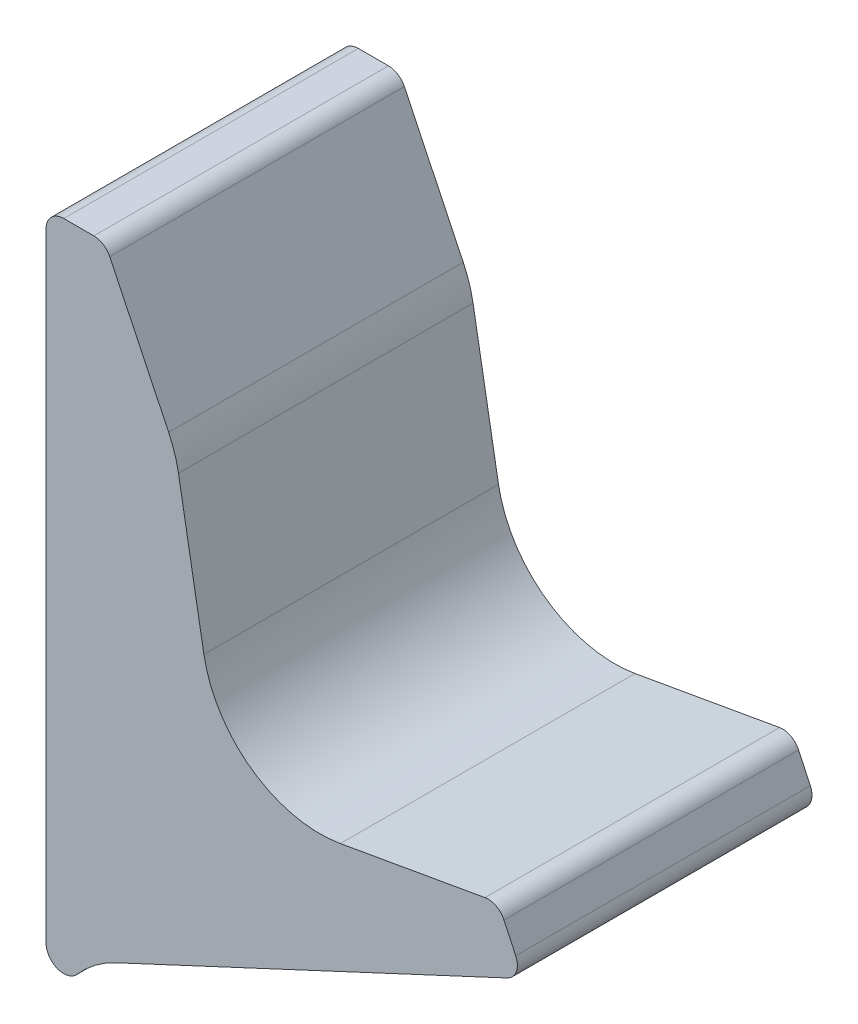
ISO-10303-21;
HEADER;
FILE_DESCRIPTION(('STEP AP214'),'2;1');
FILE_NAME('part.step','',(''),(''),'','','');
FILE_SCHEMA(('AUTOMOTIVE_DESIGN { 1 0 10303 214 1 1 1 1 }'));
ENDSEC;
DATA;
#1=APPLICATION_CONTEXT('core data for automotive mechanical design processes');
#2=APPLICATION_PROTOCOL_DEFINITION('international standard','automotive_design',2000,#1);
#3=PRODUCT_CONTEXT('',#1,'mechanical');
#4=PRODUCT('Part','Part','',(#3));
#5=PRODUCT_RELATED_PRODUCT_CATEGORY('part','',(#4));
#6=PRODUCT_DEFINITION_FORMATION('','',#4);
#7=PRODUCT_DEFINITION_CONTEXT('part definition',#1,'design');
#8=PRODUCT_DEFINITION('design','',#6,#7);
#9=PRODUCT_DEFINITION_SHAPE('','',#8);
#10=(LENGTH_UNIT() NAMED_UNIT(*) SI_UNIT(.MILLI.,.METRE.));
#11=(NAMED_UNIT(*) PLANE_ANGLE_UNIT() SI_UNIT($,.RADIAN.));
#12=(NAMED_UNIT(*) SI_UNIT($,.STERADIAN.) SOLID_ANGLE_UNIT());
#13=UNCERTAINTY_MEASURE_WITH_UNIT(LENGTH_MEASURE(1.E-05),#10,'distance_accuracy_value','');
#14=(GEOMETRIC_REPRESENTATION_CONTEXT(3) GLOBAL_UNCERTAINTY_ASSIGNED_CONTEXT((#13)) GLOBAL_UNIT_ASSIGNED_CONTEXT((#10,
#11,#12)) REPRESENTATION_CONTEXT('',''));
#15=CARTESIAN_POINT('',(0.,0.,0.));
#16=DIRECTION('',(0.,0.,1.));
#17=DIRECTION('',(1.,0.,0.));
#18=AXIS2_PLACEMENT_3D('',#15,#16,#17);
#19=CARTESIAN_POINT('',(3.00000000000001,-108.,25.));
#20=DIRECTION('',(0.,0.,-1.));
#21=DIRECTION('',(-1.,0.,0.));
#22=AXIS2_PLACEMENT_3D('',#19,#20,#21);
#23=CYLINDRICAL_SURFACE('',#22,3.);
#24=CARTESIAN_POINT('',(3.00000000000001,-108.,-25.));
#25=DIRECTION('',(0.,0.,1.));
#26=DIRECTION('',(1.,0.,0.));
#27=AXIS2_PLACEMENT_3D('',#24,#25,#26);
#28=CIRCLE('',#27,3.);
#29=CARTESIAN_POINT('',(0.,-108.,-25.));
#30=VERTEX_POINT('',#29);
#31=CARTESIAN_POINT('',(5.26655271543777,-109.965385150077,-25.));
#32=VERTEX_POINT('',#31);
#33=EDGE_CURVE('E178',#30,#32,#28,.T.);
#34=ORIENTED_EDGE('',*,*,#33,.T.);
#35=DIRECTION('',(0.,0.,-1.));
#36=VECTOR('',#35,1.);
#37=CARTESIAN_POINT('',(5.26655271543777,-109.965385150077,25.));
#38=LINE('',#37,#36);
#39=CARTESIAN_POINT('',(5.26655271543777,-109.965385150077,25.));
#40=VERTEX_POINT('',#39);
#41=EDGE_CURVE('E11',#40,#32,#38,.T.);
#42=ORIENTED_EDGE('',*,*,#41,.F.);
#43=CARTESIAN_POINT('',(3.00000000000001,-108.,25.));
#44=DIRECTION('',(0.,0.,1.));
#45=DIRECTION('',(1.,0.,0.));
#46=AXIS2_PLACEMENT_3D('',#43,#44,#45);
#47=CIRCLE('',#46,3.);
#48=CARTESIAN_POINT('',(0.,-108.,25.));
#49=VERTEX_POINT('',#48);
#50=EDGE_CURVE('E207',#49,#40,#47,.T.);
#51=ORIENTED_EDGE('',*,*,#50,.F.);
#52=DIRECTION('',(0.,0.,-1.));
#53=VECTOR('',#52,1.);
#54=CARTESIAN_POINT('',(0.,-108.,25.));
#55=LINE('',#54,#53);
#56=EDGE_CURVE('E174',#49,#30,#55,.T.);
#57=ORIENTED_EDGE('',*,*,#56,.T.);
#58=EDGE_LOOP('',(#34,#42,#51,#57));
#59=FACE_BOUND('',#58,.T.);
#60=ADVANCED_FACE('F39',(#59),#23,.T.);
#61=CARTESIAN_POINT('',(20.3769041516896,-123.067952817254,25.));
#62=DIRECTION('',(0.,0.,-1.));
#63=DIRECTION('',(-1.,0.,0.));
#64=AXIS2_PLACEMENT_3D('',#61,#62,#63);
#65=CYLINDRICAL_SURFACE('',#64,20.);
#66=CARTESIAN_POINT('',(20.3769041516896,-123.067952817254,-25.));
#67=DIRECTION('',(0.,0.,-1.));
#68=DIRECTION('',(-1.,0.,0.));
#69=AXIS2_PLACEMENT_3D('',#66,#67,#68);
#70=CIRCLE('',#69,20.);
#71=CARTESIAN_POINT('',(11.9245389168755,-104.941797076521,-25.));
#72=VERTEX_POINT('',#71);
#73=EDGE_CURVE('E181',#32,#72,#70,.T.);
#74=ORIENTED_EDGE('',*,*,#73,.T.);
#75=DIRECTION('',(0.,0.,-1.));
#76=VECTOR('',#75,1.);
#77=CARTESIAN_POINT('',(11.9245389168755,-104.941797076521,25.));
#78=LINE('',#77,#76);
#79=CARTESIAN_POINT('',(11.9245389168755,-104.941797076521,25.));
#80=VERTEX_POINT('',#79);
#81=EDGE_CURVE('E47',#80,#72,#78,.T.);
#82=ORIENTED_EDGE('',*,*,#81,.F.);
#83=CARTESIAN_POINT('',(20.3769041516896,-123.067952817254,25.));
#84=DIRECTION('',(0.,0.,-1.));
#85=DIRECTION('',(-1.,0.,0.));
#86=AXIS2_PLACEMENT_3D('',#83,#84,#85);
#87=CIRCLE('',#86,20.);
#88=EDGE_CURVE('E117',#40,#80,#87,.T.);
#89=ORIENTED_EDGE('',*,*,#88,.F.);
#90=ORIENTED_EDGE('',*,*,#41,.T.);
#91=EDGE_LOOP('',(#74,#82,#89,#90));
#92=FACE_BOUND('',#91,.T.);
#93=ADVANCED_FACE('F290',(#92),#65,.F.);
#94=CARTESIAN_POINT('',(11.9245389168755,-104.941797076521,25.));
#95=DIRECTION('',(-0.422618261740704,0.906307787036648,0.));
#96=DIRECTION('',(-0.906307787036648,-0.422618261740704,0.));
#97=AXIS2_PLACEMENT_3D('',#94,#95,#96);
#98=PLANE('',#97);
#99=DIRECTION('',(0.906307787036648,0.422618261740704,0.));
#100=VECTOR('',#99,1.);
#101=CARTESIAN_POINT('',(11.9245389168755,-104.941797076521,-25.));
#102=LINE('',#101,#100);
#103=CARTESIAN_POINT('',(78.2678547852221,-74.0054008197146,-25.));
#104=VERTEX_POINT('',#103);
#105=EDGE_CURVE('E183',#72,#104,#102,.T.);
#106=ORIENTED_EDGE('',*,*,#105,.T.);
#107=DIRECTION('',(0.,0.,-1.));
#108=VECTOR('',#107,1.);
#109=CARTESIAN_POINT('',(78.2678547852221,-74.0054008197146,25.));
#110=LINE('',#109,#108);
#111=CARTESIAN_POINT('',(78.2678547852221,-74.0054008197146,25.));
#112=VERTEX_POINT('',#111);
#113=EDGE_CURVE('E235',#112,#104,#110,.T.);
#114=ORIENTED_EDGE('',*,*,#113,.F.);
#115=DIRECTION('',(0.906307787036648,0.422618261740704,0.));
#116=VECTOR('',#115,1.);
#117=CARTESIAN_POINT('',(11.9245389168755,-104.941797076521,25.));
#118=LINE('',#117,#116);
#119=EDGE_CURVE('E243',#80,#112,#118,.T.);
#120=ORIENTED_EDGE('',*,*,#119,.F.);
#121=ORIENTED_EDGE('',*,*,#81,.T.);
#122=EDGE_LOOP('',(#106,#114,#120,#121));
#123=FACE_BOUND('',#122,.T.);
#124=ADVANCED_FACE('F241',(#123),#98,.F.);
#125=CARTESIAN_POINT('',(77.,-71.2864774586047,25.));
#126=DIRECTION('',(0.,0.,-1.));
#127=DIRECTION('',(-1.,0.,0.));
#128=AXIS2_PLACEMENT_3D('',#125,#126,#127);
#129=CYLINDRICAL_SURFACE('',#128,3.);
#130=CARTESIAN_POINT('',(77.,-71.2864774586047,-25.));
#131=DIRECTION('',(0.,0.,1.));
#132=DIRECTION('',(1.,0.,0.));
#133=AXIS2_PLACEMENT_3D('',#130,#131,#132);
#134=CIRCLE('',#133,3.);
#135=CARTESIAN_POINT('',(79.7189233611099,-70.0186226733826,-25.));
#136=VERTEX_POINT('',#135);
#137=EDGE_CURVE('E185',#104,#136,#134,.T.);
#138=ORIENTED_EDGE('',*,*,#137,.T.);
#139=DIRECTION('',(0.,0.,-1.));
#140=VECTOR('',#139,1.);
#141=CARTESIAN_POINT('',(79.7189233611099,-70.0186226733826,25.));
#142=LINE('',#141,#140);
#143=CARTESIAN_POINT('',(79.7189233611099,-70.0186226733826,25.));
#144=VERTEX_POINT('',#143);
#145=EDGE_CURVE('E232',#144,#136,#142,.T.);
#146=ORIENTED_EDGE('',*,*,#145,.F.);
#147=CARTESIAN_POINT('',(77.,-71.2864774586047,25.));
#148=DIRECTION('',(0.,0.,1.));
#149=DIRECTION('',(1.,0.,0.));
#150=AXIS2_PLACEMENT_3D('',#147,#148,#149);
#151=CIRCLE('',#150,3.);
#152=EDGE_CURVE('E259',#112,#144,#151,.T.);
#153=ORIENTED_EDGE('',*,*,#152,.F.);
#154=ORIENTED_EDGE('',*,*,#113,.T.);
#155=EDGE_LOOP('',(#138,#146,#153,#154));
#156=FACE_BOUND('',#155,.T.);
#157=ADVANCED_FACE('F250',(#156),#129,.T.);
#158=CARTESIAN_POINT('',(79.7189233611099,-70.0186226733826,25.));
#159=DIRECTION('',(-0.906307787036648,-0.422618261740705,0.));
#160=DIRECTION('',(0.422618261740705,-0.906307787036648,0.));
#161=AXIS2_PLACEMENT_3D('',#158,#159,#160);
#162=PLANE('',#161);
#163=DIRECTION('',(-0.422618261740705,0.906307787036648,0.));
#164=VECTOR('',#163,1.);
#165=CARTESIAN_POINT('',(79.7189233611099,-70.0186226733826,-25.));
#166=LINE('',#165,#164);
#167=CARTESIAN_POINT('',(77.7334547224642,-65.7607714373522,-25.));
#168=VERTEX_POINT('',#167);
#169=EDGE_CURVE('E187',#136,#168,#166,.T.);
#170=ORIENTED_EDGE('',*,*,#169,.T.);
#171=DIRECTION('',(0.,0.,-1.));
#172=VECTOR('',#171,1.);
#173=CARTESIAN_POINT('',(77.7334547224642,-65.7607714373522,25.));
#174=LINE('',#173,#172);
#175=CARTESIAN_POINT('',(77.7334547224642,-65.7607714373522,25.));
#176=VERTEX_POINT('',#175);
#177=EDGE_CURVE('E229',#176,#168,#174,.T.);
#178=ORIENTED_EDGE('',*,*,#177,.F.);
#179=DIRECTION('',(-0.422618261740705,0.906307787036648,0.));
#180=VECTOR('',#179,1.);
#181=CARTESIAN_POINT('',(79.7189233611099,-70.0186226733826,25.));
#182=LINE('',#181,#180);
#183=EDGE_CURVE('E256',#144,#176,#182,.T.);
#184=ORIENTED_EDGE('',*,*,#183,.F.);
#185=ORIENTED_EDGE('',*,*,#145,.T.);
#186=EDGE_LOOP('',(#170,#178,#184,#185));
#187=FACE_BOUND('',#186,.T.);
#188=ADVANCED_FACE('F254',(#187),#162,.F.);
#189=CARTESIAN_POINT('',(75.0145313613543,-67.0286262225743,25.));
#190=DIRECTION('',(0.,0.,-1.));
#191=DIRECTION('',(-1.,0.,0.));
#192=AXIS2_PLACEMENT_3D('',#189,#190,#191);
#193=CYLINDRICAL_SURFACE('',#192,3.00000000000001);
#194=CARTESIAN_POINT('',(75.0145313613543,-67.0286262225743,-25.));
#195=DIRECTION('',(0.,0.,1.));
#196=DIRECTION('',(1.,0.,0.));
#197=AXIS2_PLACEMENT_3D('',#194,#195,#196);
#198=CIRCLE('',#197,3.00000000000001);
#199=CARTESIAN_POINT('',(74.4935868283534,-64.0742029635376,-25.));
#200=VERTEX_POINT('',#199);
#201=EDGE_CURVE('E189',#168,#200,#198,.T.);
#202=ORIENTED_EDGE('',*,*,#201,.T.);
#203=DIRECTION('',(0.,0.,-1.));
#204=VECTOR('',#203,1.);
#205=CARTESIAN_POINT('',(74.4935868283534,-64.0742029635376,25.));
#206=LINE('',#205,#204);
#207=CARTESIAN_POINT('',(74.4935868283534,-64.0742029635376,25.));
#208=VERTEX_POINT('',#207);
#209=EDGE_CURVE('E226',#208,#200,#206,.T.);
#210=ORIENTED_EDGE('',*,*,#209,.F.);
#211=CARTESIAN_POINT('',(75.0145313613543,-67.0286262225743,25.));
#212=DIRECTION('',(0.,0.,1.));
#213=DIRECTION('',(1.,0.,0.));
#214=AXIS2_PLACEMENT_3D('',#211,#212,#213);
#215=CIRCLE('',#214,3.00000000000001);
#216=EDGE_CURVE('E258',#176,#208,#215,.T.);
#217=ORIENTED_EDGE('',*,*,#216,.F.);
#218=ORIENTED_EDGE('',*,*,#177,.T.);
#219=EDGE_LOOP('',(#202,#210,#217,#218));
#220=FACE_BOUND('',#219,.T.);
#221=ADVANCED_FACE('F302',(#220),#193,.T.);
#222=CARTESIAN_POINT('',(74.4935868283534,-64.0742029635376,25.));
#223=DIRECTION('',(0.173648177666942,-0.984807753012206,0.));
#224=DIRECTION('',(0.984807753012206,0.173648177666942,0.));
#225=AXIS2_PLACEMENT_3D('',#222,#223,#224);
#226=PLANE('',#225);
#227=DIRECTION('',(-0.984807753012206,-0.173648177666942,0.));
#228=VECTOR('',#227,1.);
#229=CARTESIAN_POINT('',(74.4935868283534,-64.0742029635376,-25.));
#230=LINE('',#229,#228);
#231=CARTESIAN_POINT('',(49.9611126327896,-68.3999400677501,-25.));
#232=VERTEX_POINT('',#231);
#233=EDGE_CURVE('E191',#200,#232,#230,.T.);
#234=ORIENTED_EDGE('',*,*,#233,.T.);
#235=DIRECTION('',(0.,0.,-1.));
#236=VECTOR('',#235,1.);
#237=CARTESIAN_POINT('',(49.9611126327896,-68.3999400677501,25.));
#238=LINE('',#237,#236);
#239=CARTESIAN_POINT('',(49.9611126327896,-68.3999400677501,25.));
#240=VERTEX_POINT('',#239);
#241=EDGE_CURVE('E223',#240,#232,#238,.T.);
#242=ORIENTED_EDGE('',*,*,#241,.F.);
#243=DIRECTION('',(-0.984807753012206,-0.173648177666942,0.));
#244=VECTOR('',#243,1.);
#245=CARTESIAN_POINT('',(74.4935868283534,-64.0742029635376,25.));
#246=LINE('',#245,#244);
#247=EDGE_CURVE('E261',#208,#240,#246,.T.);
#248=ORIENTED_EDGE('',*,*,#247,.F.);
#249=ORIENTED_EDGE('',*,*,#209,.T.);
#250=EDGE_LOOP('',(#234,#242,#248,#249));
#251=FACE_BOUND('',#250,.T.);
#252=ADVANCED_FACE('F305',(#251),#226,.F.);
#253=CARTESIAN_POINT('',(46.4881490794508,-48.7037850075059,25.));
#254=DIRECTION('',(0.,0.,-1.));
#255=DIRECTION('',(-1.,0.,0.));
#256=AXIS2_PLACEMENT_3D('',#253,#254,#255);
#257=CYLINDRICAL_SURFACE('',#256,20.);
#258=CARTESIAN_POINT('',(46.4881490794508,-48.7037850075059,-25.));
#259=DIRECTION('',(0.,0.,-1.));
#260=DIRECTION('',(-1.,0.,0.));
#261=AXIS2_PLACEMENT_3D('',#258,#259,#260);
#262=CIRCLE('',#261,20.);
#263=CARTESIAN_POINT('',(26.7919940192066,-52.1767485608444,-25.));
#264=VERTEX_POINT('',#263);
#265=EDGE_CURVE('E193',#232,#264,#262,.T.);
#266=ORIENTED_EDGE('',*,*,#265,.T.);
#267=DIRECTION('',(0.,0.,-1.));
#268=VECTOR('',#267,1.);
#269=CARTESIAN_POINT('',(26.7919940192066,-52.1767485608444,25.));
#270=LINE('',#269,#268);
#271=CARTESIAN_POINT('',(26.7919940192066,-52.1767485608444,25.));
#272=VERTEX_POINT('',#271);
#273=EDGE_CURVE('E220',#272,#264,#270,.T.);
#274=ORIENTED_EDGE('',*,*,#273,.F.);
#275=CARTESIAN_POINT('',(46.4881490794508,-48.7037850075059,25.));
#276=DIRECTION('',(0.,0.,-1.));
#277=DIRECTION('',(-1.,0.,0.));
#278=AXIS2_PLACEMENT_3D('',#275,#276,#277);
#279=CIRCLE('',#278,20.);
#280=EDGE_CURVE('E267',#240,#272,#279,.T.);
#281=ORIENTED_EDGE('',*,*,#280,.F.);
#282=ORIENTED_EDGE('',*,*,#241,.T.);
#283=EDGE_LOOP('',(#266,#274,#281,#282));
#284=FACE_BOUND('',#283,.T.);
#285=ADVANCED_FACE('F309',(#284),#257,.F.);
#286=CARTESIAN_POINT('',(26.7919940192066,-52.1767485608444,25.));
#287=DIRECTION('',(-0.984807753012209,-0.173648177666924,0.));
#288=DIRECTION('',(0.173648177666924,-0.984807753012209,0.));
#289=AXIS2_PLACEMENT_3D('',#286,#287,#288);
#290=PLANE('',#289);
#291=DIRECTION('',(-0.173648177666924,0.984807753012209,0.));
#292=VECTOR('',#291,1.);
#293=CARTESIAN_POINT('',(26.7919940192066,-52.1767485608444,-25.));
#294=LINE('',#293,#292);
#295=CARTESIAN_POINT('',(22.4770029885421,-27.7052183768224,-25.));
#296=VERTEX_POINT('',#295);
#297=EDGE_CURVE('E195',#264,#296,#294,.T.);
#298=ORIENTED_EDGE('',*,*,#297,.T.);
#299=DIRECTION('',(0.,0.,-1.));
#300=VECTOR('',#299,1.);
#301=CARTESIAN_POINT('',(22.4770029885421,-27.7052183768224,25.));
#302=LINE('',#301,#300);
#303=CARTESIAN_POINT('',(22.4770029885421,-27.7052183768224,25.));
#304=VERTEX_POINT('',#303);
#305=EDGE_CURVE('E217',#304,#296,#302,.T.);
#306=ORIENTED_EDGE('',*,*,#305,.F.);
#307=DIRECTION('',(-0.173648177666924,0.984807753012209,0.));
#308=VECTOR('',#307,1.);
#309=CARTESIAN_POINT('',(26.7919940192066,-52.1767485608444,25.));
#310=LINE('',#309,#308);
#311=EDGE_CURVE('E269',#272,#304,#310,.T.);
#312=ORIENTED_EDGE('',*,*,#311,.F.);
#313=ORIENTED_EDGE('',*,*,#273,.T.);
#314=EDGE_LOOP('',(#298,#306,#312,#313));
#315=FACE_BOUND('',#314,.T.);
#316=ADVANCED_FACE('F313',(#315),#290,.F.);
#317=CARTESIAN_POINT('',(2.78084792829795,-31.1781819301609,25.));
#318=DIRECTION('',(0.,0.,-1.));
#319=DIRECTION('',(-1.,0.,0.));
#320=AXIS2_PLACEMENT_3D('',#317,#318,#319);
#321=CYLINDRICAL_SURFACE('',#320,20.);
#322=CARTESIAN_POINT('',(2.78084792829795,-31.1781819301609,-25.));
#323=DIRECTION('',(0.,0.,1.));
#324=DIRECTION('',(1.,0.,0.));
#325=AXIS2_PLACEMENT_3D('',#322,#323,#324);
#326=CIRCLE('',#325,20.);
#327=CARTESIAN_POINT('',(20.8113090776634,-22.5235605784655,-25.));
#328=VERTEX_POINT('',#327);
#329=EDGE_CURVE('E197',#296,#328,#326,.T.);
#330=ORIENTED_EDGE('',*,*,#329,.T.);
#331=DIRECTION('',(0.,0.,-1.));
#332=VECTOR('',#331,1.);
#333=CARTESIAN_POINT('',(20.8113090776634,-22.5235605784655,25.));
#334=LINE('',#333,#332);
#335=CARTESIAN_POINT('',(20.8113090776634,-22.5235605784655,25.));
#336=VERTEX_POINT('',#335);
#337=EDGE_CURVE('E214',#336,#328,#334,.T.);
#338=ORIENTED_EDGE('',*,*,#337,.F.);
#339=CARTESIAN_POINT('',(2.78084792829795,-31.1781819301609,25.));
#340=DIRECTION('',(0.,0.,1.));
#341=DIRECTION('',(1.,0.,0.));
#342=AXIS2_PLACEMENT_3D('',#339,#340,#341);
#343=CIRCLE('',#342,20.);
#344=EDGE_CURVE('E271',#304,#336,#343,.T.);
#345=ORIENTED_EDGE('',*,*,#344,.F.);
#346=ORIENTED_EDGE('',*,*,#305,.T.);
#347=EDGE_LOOP('',(#330,#338,#345,#346));
#348=FACE_BOUND('',#347,.T.);
#349=ADVANCED_FACE('F317',(#348),#321,.T.);
#350=CARTESIAN_POINT('',(20.8113090776634,-22.5235605784655,25.));
#351=DIRECTION('',(-0.901523057468274,-0.432731067584771,0.));
#352=DIRECTION('',(0.432731067584771,-0.901523057468274,0.));
#353=AXIS2_PLACEMENT_3D('',#350,#351,#352);
#354=PLANE('',#353);
#355=DIRECTION('',(-0.432731067584771,0.901523057468274,0.));
#356=VECTOR('',#355,1.);
#357=CARTESIAN_POINT('',(20.8113090776634,-22.5235605784655,-25.));
#358=LINE('',#357,#356);
#359=CARTESIAN_POINT('',(10.8168672626779,-1.70180679724569,-25.));
#360=VERTEX_POINT('',#359);
#361=EDGE_CURVE('E199',#328,#360,#358,.T.);
#362=ORIENTED_EDGE('',*,*,#361,.T.);
#363=DIRECTION('',(0.,0.,-1.));
#364=VECTOR('',#363,1.);
#365=CARTESIAN_POINT('',(10.8168672626779,-1.70180679724569,25.));
#366=LINE('',#365,#364);
#367=CARTESIAN_POINT('',(10.8168672626779,-1.70180679724569,25.));
#368=VERTEX_POINT('',#367);
#369=EDGE_CURVE('E211',#368,#360,#366,.T.);
#370=ORIENTED_EDGE('',*,*,#369,.F.);
#371=DIRECTION('',(-0.432731067584771,0.901523057468274,0.));
#372=VECTOR('',#371,1.);
#373=CARTESIAN_POINT('',(20.8113090776634,-22.5235605784655,25.));
#374=LINE('',#373,#372);
#375=EDGE_CURVE('E273',#336,#368,#374,.T.);
#376=ORIENTED_EDGE('',*,*,#375,.F.);
#377=ORIENTED_EDGE('',*,*,#337,.T.);
#378=EDGE_LOOP('',(#362,#370,#376,#377));
#379=FACE_BOUND('',#378,.T.);
#380=ADVANCED_FACE('F279',(#379),#354,.F.);
#381=CARTESIAN_POINT('',(8.11229809027311,-3.,25.));
#382=DIRECTION('',(0.,0.,-1.));
#383=DIRECTION('',(-1.,0.,0.));
#384=AXIS2_PLACEMENT_3D('',#381,#382,#383);
#385=CYLINDRICAL_SURFACE('',#384,3.);
#386=CARTESIAN_POINT('',(8.11229809027311,-3.,-25.));
#387=DIRECTION('',(0.,0.,1.));
#388=DIRECTION('',(1.,0.,0.));
#389=AXIS2_PLACEMENT_3D('',#386,#387,#388);
#390=CIRCLE('',#389,3.);
#391=CARTESIAN_POINT('',(8.11229809027311,0.,-25.));
#392=VERTEX_POINT('',#391);
#393=EDGE_CURVE('E201',#360,#392,#390,.T.);
#394=ORIENTED_EDGE('',*,*,#393,.T.);
#395=DIRECTION('',(0.,0.,-1.));
#396=VECTOR('',#395,1.);
#397=CARTESIAN_POINT('',(8.11229809027311,0.,25.));
#398=LINE('',#397,#396);
#399=CARTESIAN_POINT('',(8.11229809027311,0.,25.));
#400=VERTEX_POINT('',#399);
#401=EDGE_CURVE('E169',#400,#392,#398,.T.);
#402=ORIENTED_EDGE('',*,*,#401,.F.);
#403=CARTESIAN_POINT('',(8.11229809027311,-3.,25.));
#404=DIRECTION('',(0.,0.,1.));
#405=DIRECTION('',(1.,0.,0.));
#406=AXIS2_PLACEMENT_3D('',#403,#404,#405);
#407=CIRCLE('',#406,3.);
#408=EDGE_CURVE('E158',#368,#400,#407,.T.);
#409=ORIENTED_EDGE('',*,*,#408,.F.);
#410=ORIENTED_EDGE('',*,*,#369,.T.);
#411=EDGE_LOOP('',(#394,#402,#409,#410));
#412=FACE_BOUND('',#411,.T.);
#413=ADVANCED_FACE('F283',(#412),#385,.T.);
#414=CARTESIAN_POINT('',(8.11229809027311,0.,25.));
#415=DIRECTION('',(0.,-1.,0.));
#416=DIRECTION('',(0.,0.,-1.));
#417=AXIS2_PLACEMENT_3D('',#414,#415,#416);
#418=PLANE('',#417);
#419=DIRECTION('',(-1.,0.,0.));
#420=VECTOR('',#419,1.);
#421=CARTESIAN_POINT('',(8.11229809027311,0.,-25.));
#422=LINE('',#421,#420);
#423=CARTESIAN_POINT('',(3.00000000000002,0.,-25.));
#424=VERTEX_POINT('',#423);
#425=EDGE_CURVE('E167',#392,#424,#422,.T.);
#426=ORIENTED_EDGE('',*,*,#425,.T.);
#427=DIRECTION('',(0.,0.,-1.));
#428=VECTOR('',#427,1.);
#429=CARTESIAN_POINT('',(3.00000000000002,0.,25.));
#430=LINE('',#429,#428);
#431=CARTESIAN_POINT('',(3.00000000000002,0.,25.));
#432=VERTEX_POINT('',#431);
#433=EDGE_CURVE('E164',#432,#424,#430,.T.);
#434=ORIENTED_EDGE('',*,*,#433,.F.);
#435=DIRECTION('',(-1.,0.,0.));
#436=VECTOR('',#435,1.);
#437=CARTESIAN_POINT('',(8.11229809027311,0.,25.));
#438=LINE('',#437,#436);
#439=EDGE_CURVE('E151',#400,#432,#438,.T.);
#440=ORIENTED_EDGE('',*,*,#439,.F.);
#441=ORIENTED_EDGE('',*,*,#401,.T.);
#442=EDGE_LOOP('',(#426,#434,#440,#441));
#443=FACE_BOUND('',#442,.T.);
#444=ADVANCED_FACE('F165',(#443),#418,.F.);
#445=CARTESIAN_POINT('',(3.,-3.,25.));
#446=DIRECTION('',(0.,0.,-1.));
#447=DIRECTION('',(-1.,0.,0.));
#448=AXIS2_PLACEMENT_3D('',#445,#446,#447);
#449=CYLINDRICAL_SURFACE('',#448,3.);
#450=CARTESIAN_POINT('',(3.,-3.,-25.));
#451=DIRECTION('',(0.,0.,1.));
#452=DIRECTION('',(-1.,0.,0.));
#453=AXIS2_PLACEMENT_3D('',#450,#451,#452);
#454=CIRCLE('',#453,3.);
#455=CARTESIAN_POINT('',(0.,-3.00000000000002,-25.));
#456=VERTEX_POINT('',#455);
#457=EDGE_CURVE('E204',#424,#456,#454,.T.);
#458=ORIENTED_EDGE('',*,*,#457,.T.);
#459=DIRECTION('',(0.,0.,-1.));
#460=VECTOR('',#459,1.);
#461=CARTESIAN_POINT('',(0.,-3.00000000000002,25.));
#462=LINE('',#461,#460);
#463=CARTESIAN_POINT('',(0.,-3.00000000000002,25.));
#464=VERTEX_POINT('',#463);
#465=EDGE_CURVE('E170',#464,#456,#462,.T.);
#466=ORIENTED_EDGE('',*,*,#465,.F.);
#467=CARTESIAN_POINT('',(3.,-3.,25.));
#468=DIRECTION('',(0.,0.,1.));
#469=DIRECTION('',(-1.,0.,0.));
#470=AXIS2_PLACEMENT_3D('',#467,#468,#469);
#471=CIRCLE('',#470,3.);
#472=EDGE_CURVE('E155',#432,#464,#471,.T.);
#473=ORIENTED_EDGE('',*,*,#472,.F.);
#474=ORIENTED_EDGE('',*,*,#433,.T.);
#475=EDGE_LOOP('',(#458,#466,#473,#474));
#476=FACE_BOUND('',#475,.T.);
#477=ADVANCED_FACE('F172',(#476),#449,.T.);
#478=CARTESIAN_POINT('',(0.,-53.7849885754929,25.));
#479=DIRECTION('',(1.,0.,0.));
#480=DIRECTION('',(0.,1.,0.));
#481=AXIS2_PLACEMENT_3D('',#478,#479,#480);
#482=PLANE('',#481);
#483=DIRECTION('',(0.,-1.,0.));
#484=VECTOR('',#483,1.);
#485=CARTESIAN_POINT('',(0.,-53.7849885754929,-25.));
#486=LINE('',#485,#484);
#487=EDGE_CURVE('E105',#456,#30,#486,.T.);
#488=ORIENTED_EDGE('',*,*,#487,.T.);
#489=ORIENTED_EDGE('',*,*,#56,.F.);
#490=DIRECTION('',(0.,-1.,0.));
#491=VECTOR('',#490,1.);
#492=CARTESIAN_POINT('',(0.,-3.00000000000002,25.));
#493=LINE('',#492,#491);
#494=EDGE_CURVE('E55',#464,#49,#493,.T.);
#495=ORIENTED_EDGE('',*,*,#494,.F.);
#496=ORIENTED_EDGE('',*,*,#465,.T.);
#497=EDGE_LOOP('',(#488,#489,#495,#496));
#498=FACE_BOUND('',#497,.T.);
#499=ADVANCED_FACE('F284',(#498),#482,.F.);
#500=CARTESIAN_POINT('',(3.00000000000001,-108.,25.));
#501=DIRECTION('',(0.,0.,1.));
#502=DIRECTION('',(1.,0.,0.));
#503=AXIS2_PLACEMENT_3D('',#500,#501,#502);
#504=PLANE('',#503);
#505=ORIENTED_EDGE('',*,*,#50,.T.);
#506=ORIENTED_EDGE('',*,*,#88,.T.);
#507=ORIENTED_EDGE('',*,*,#119,.T.);
#508=ORIENTED_EDGE('',*,*,#152,.T.);
#509=ORIENTED_EDGE('',*,*,#183,.T.);
#510=ORIENTED_EDGE('',*,*,#216,.T.);
#511=ORIENTED_EDGE('',*,*,#247,.T.);
#512=ORIENTED_EDGE('',*,*,#280,.T.);
#513=ORIENTED_EDGE('',*,*,#311,.T.);
#514=ORIENTED_EDGE('',*,*,#344,.T.);
#515=ORIENTED_EDGE('',*,*,#375,.T.);
#516=ORIENTED_EDGE('',*,*,#408,.T.);
#517=ORIENTED_EDGE('',*,*,#439,.T.);
#518=ORIENTED_EDGE('',*,*,#472,.T.);
#519=ORIENTED_EDGE('',*,*,#494,.T.);
#520=EDGE_LOOP('',(#505,#506,#507,#508,#509,#510,#511,#512,#513,#514,#515,#516,#517,#518,#519));
#521=FACE_BOUND('',#520,.T.);
#522=ADVANCED_FACE('F153',(#521),#504,.T.);
#523=CARTESIAN_POINT('',(3.00000000000001,-108.,-25.));
#524=DIRECTION('',(0.,0.,1.));
#525=DIRECTION('',(1.,0.,0.));
#526=AXIS2_PLACEMENT_3D('',#523,#524,#525);
#527=PLANE('',#526);
#528=ORIENTED_EDGE('',*,*,#33,.F.);
#529=ORIENTED_EDGE('',*,*,#487,.F.);
#530=ORIENTED_EDGE('',*,*,#457,.F.);
#531=ORIENTED_EDGE('',*,*,#425,.F.);
#532=ORIENTED_EDGE('',*,*,#393,.F.);
#533=ORIENTED_EDGE('',*,*,#361,.F.);
#534=ORIENTED_EDGE('',*,*,#329,.F.);
#535=ORIENTED_EDGE('',*,*,#297,.F.);
#536=ORIENTED_EDGE('',*,*,#265,.F.);
#537=ORIENTED_EDGE('',*,*,#233,.F.);
#538=ORIENTED_EDGE('',*,*,#201,.F.);
#539=ORIENTED_EDGE('',*,*,#169,.F.);
#540=ORIENTED_EDGE('',*,*,#137,.F.);
#541=ORIENTED_EDGE('',*,*,#105,.F.);
#542=ORIENTED_EDGE('',*,*,#73,.F.);
#543=EDGE_LOOP('',(#528,#529,#530,#531,#532,#533,#534,#535,#536,#537,#538,#539,#540,#541,#542));
#544=FACE_BOUND('',#543,.T.);
#545=ADVANCED_FACE('F245',(#544),#527,.F.);
#546=CLOSED_SHELL('',(#60,#93,#124,#157,#188,#221,#252,#285,#316,#349,#380,#413,#444,#477,#499,
#522,#545));
#547=MANIFOLD_SOLID_BREP('B2',#546);
#548=ADVANCED_BREP_SHAPE_REPRESENTATION('',(#18,#547),#14);
#549=SHAPE_DEFINITION_REPRESENTATION(#9,#548);
ENDSEC;
END-ISO-10303-21;
